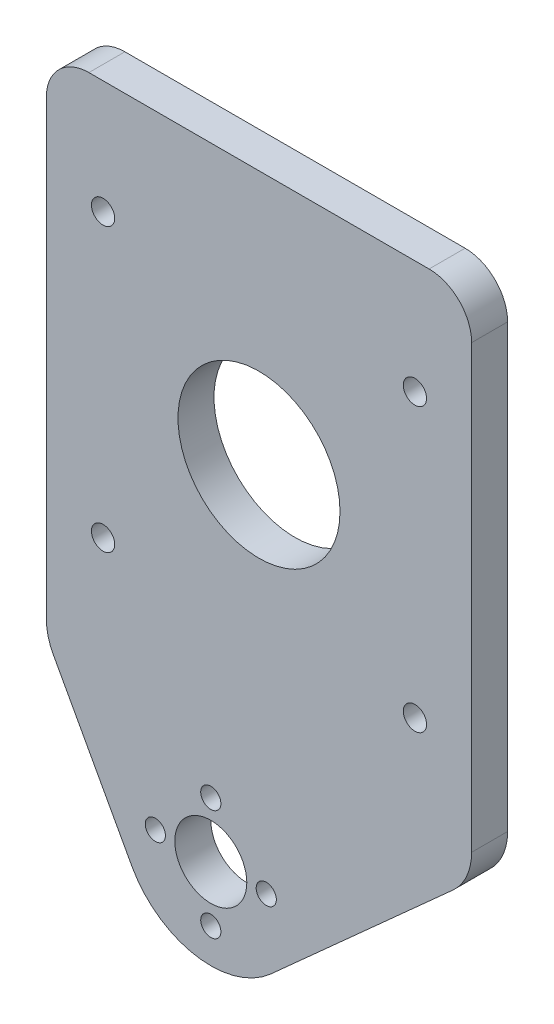
ISO-10303-21;
HEADER;
FILE_DESCRIPTION(('STEP AP214'),'2;1');
FILE_NAME('part.step','',(''),(''),'','','');
FILE_SCHEMA(('AUTOMOTIVE_DESIGN { 1 0 10303 214 1 1 1 1 }'));
ENDSEC;
DATA;
#1=APPLICATION_CONTEXT('core data for automotive mechanical design processes');
#2=APPLICATION_PROTOCOL_DEFINITION('international standard','automotive_design',2000,#1);
#3=PRODUCT_CONTEXT('',#1,'mechanical');
#4=PRODUCT('Part','Part','',(#3));
#5=PRODUCT_RELATED_PRODUCT_CATEGORY('part','',(#4));
#6=PRODUCT_DEFINITION_FORMATION('','',#4);
#7=PRODUCT_DEFINITION_CONTEXT('part definition',#1,'design');
#8=PRODUCT_DEFINITION('design','',#6,#7);
#9=PRODUCT_DEFINITION_SHAPE('','',#8);
#10=(LENGTH_UNIT() NAMED_UNIT(*) SI_UNIT(.MILLI.,.METRE.));
#11=(NAMED_UNIT(*) PLANE_ANGLE_UNIT() SI_UNIT($,.RADIAN.));
#12=(NAMED_UNIT(*) SI_UNIT($,.STERADIAN.) SOLID_ANGLE_UNIT());
#13=UNCERTAINTY_MEASURE_WITH_UNIT(LENGTH_MEASURE(1.E-05),#10,'distance_accuracy_value','');
#14=(GEOMETRIC_REPRESENTATION_CONTEXT(3) GLOBAL_UNCERTAINTY_ASSIGNED_CONTEXT((#13)) GLOBAL_UNIT_ASSIGNED_CONTEXT((#10,
#11,#12)) REPRESENTATION_CONTEXT('',''));
#15=CARTESIAN_POINT('',(0.,0.,0.));
#16=DIRECTION('',(0.,0.,1.));
#17=DIRECTION('',(1.,0.,0.));
#18=AXIS2_PLACEMENT_3D('',#15,#16,#17);
#19=CARTESIAN_POINT('',(0.,0.,6.35));
#20=DIRECTION('',(0.,0.,-1.));
#21=DIRECTION('',(-1.,0.,0.));
#22=AXIS2_PLACEMENT_3D('',#19,#20,#21);
#23=PLANE('',#22);
#24=CARTESIAN_POINT('',(179.9,20.,6.35));
#25=DIRECTION('',(0.,0.,1.));
#26=DIRECTION('',(-1.,0.,0.));
#27=AXIS2_PLACEMENT_3D('',#24,#25,#26);
#28=CIRCLE('',#27,2.04999999999999);
#29=CARTESIAN_POINT('',(177.85,20.,6.35));
#30=VERTEX_POINT('',#29);
#31=EDGE_CURVE('E250',#30,#30,#28,.T.);
#32=ORIENTED_EDGE('',*,*,#31,.F.);
#33=EDGE_LOOP('',(#32));
#34=FACE_BOUND('',#33,.T.);
#35=CARTESIAN_POINT('',(124.9,20.,6.35));
#36=DIRECTION('',(0.,0.,1.));
#37=DIRECTION('',(-1.,0.,0.));
#38=AXIS2_PLACEMENT_3D('',#35,#36,#37);
#39=CIRCLE('',#38,2.05000000000001);
#40=CARTESIAN_POINT('',(122.85,20.,6.35));
#41=VERTEX_POINT('',#40);
#42=EDGE_CURVE('E253',#41,#41,#39,.T.);
#43=ORIENTED_EDGE('',*,*,#42,.F.);
#44=EDGE_LOOP('',(#43));
#45=FACE_BOUND('',#44,.T.);
#46=CARTESIAN_POINT('',(124.9,69.8,6.35));
#47=DIRECTION('',(0.,0.,1.));
#48=DIRECTION('',(1.,0.,0.));
#49=AXIS2_PLACEMENT_3D('',#46,#47,#48);
#50=CIRCLE('',#49,2.05000000000001);
#51=CARTESIAN_POINT('',(126.95,69.8,6.35));
#52=VERTEX_POINT('',#51);
#53=EDGE_CURVE('E249',#52,#52,#50,.T.);
#54=ORIENTED_EDGE('',*,*,#53,.F.);
#55=EDGE_LOOP('',(#54));
#56=FACE_BOUND('',#55,.T.);
#57=CARTESIAN_POINT('',(179.9,69.8,6.35));
#58=DIRECTION('',(0.,0.,1.));
#59=DIRECTION('',(1.,0.,0.));
#60=AXIS2_PLACEMENT_3D('',#57,#58,#59);
#61=CIRCLE('',#60,2.04999999999999);
#62=CARTESIAN_POINT('',(181.95,69.8,6.35));
#63=VERTEX_POINT('',#62);
#64=EDGE_CURVE('E203',#63,#63,#61,.T.);
#65=ORIENTED_EDGE('',*,*,#64,.F.);
#66=EDGE_LOOP('',(#65));
#67=FACE_BOUND('',#66,.T.);
#68=CARTESIAN_POINT('',(152.4,44.9,6.35));
#69=DIRECTION('',(0.,0.,1.));
#70=DIRECTION('',(1.,0.,0.));
#71=AXIS2_PLACEMENT_3D('',#68,#69,#70);
#72=CIRCLE('',#71,14.2875);
#73=CARTESIAN_POINT('',(166.6875,44.9,6.35));
#74=VERTEX_POINT('',#73);
#75=EDGE_CURVE('E158',#74,#74,#72,.T.);
#76=ORIENTED_EDGE('',*,*,#75,.F.);
#77=EDGE_LOOP('',(#76));
#78=FACE_BOUND('',#77,.T.);
#79=DIRECTION('',(-1.,0.,0.));
#80=VECTOR('',#79,1.);
#81=CARTESIAN_POINT('',(0.,89.8,6.35));
#82=LINE('',#81,#80);
#83=CARTESIAN_POINT('',(182.4,89.8,6.35));
#84=VERTEX_POINT('',#83);
#85=CARTESIAN_POINT('',(122.4,89.8,6.35));
#86=VERTEX_POINT('',#85);
#87=EDGE_CURVE('E164',#84,#86,#82,.T.);
#88=ORIENTED_EDGE('',*,*,#87,.T.);
#89=CARTESIAN_POINT('',(122.4,82.3,6.35));
#90=DIRECTION('',(0.,0.,-1.));
#91=DIRECTION('',(-1.,0.,0.));
#92=AXIS2_PLACEMENT_3D('',#89,#90,#91);
#93=CIRCLE('',#92,7.5);
#94=CARTESIAN_POINT('',(114.9,82.3,6.35));
#95=VERTEX_POINT('',#94);
#96=EDGE_CURVE('E194',#86,#95,#93,.F.);
#97=ORIENTED_EDGE('',*,*,#96,.T.);
#98=DIRECTION('',(0.,1.,0.));
#99=VECTOR('',#98,1.);
#100=CARTESIAN_POINT('',(114.9,0.,6.35));
#101=LINE('',#100,#99);
#102=CARTESIAN_POINT('',(114.9,2.55111352936032,6.35));
#103=VERTEX_POINT('',#102);
#104=EDGE_CURVE('E151',#103,#95,#101,.T.);
#105=ORIENTED_EDGE('',*,*,#104,.F.);
#106=CARTESIAN_POINT('',(124.9,2.55111352936032,6.35));
#107=DIRECTION('',(0.,0.,-1.));
#108=DIRECTION('',(-1.,0.,0.));
#109=AXIS2_PLACEMENT_3D('',#106,#107,#108);
#110=CIRCLE('',#109,10.);
#111=CARTESIAN_POINT('',(116.122099603061,-2.23934204620073,6.35));
#112=VERTEX_POINT('',#111);
#113=EDGE_CURVE('E174',#103,#112,#110,.F.);
#114=ORIENTED_EDGE('',*,*,#113,.T.);
#115=DIRECTION('',(0.479045557556106,-0.877790039693867,0.));
#116=VECTOR('',#115,1.);
#117=CARTESIAN_POINT('',(114.9,0.,6.35));
#118=LINE('',#117,#116);
#119=CARTESIAN_POINT('',(129.96508311986,-27.6048482262032,6.35));
#120=VERTEX_POINT('',#119);
#121=EDGE_CURVE('E234',#112,#120,#118,.T.);
#122=ORIENTED_EDGE('',*,*,#121,.T.);
#123=CARTESIAN_POINT('',(143.9,-20.,6.35));
#124=DIRECTION('',(0.,0.,1.));
#125=DIRECTION('',(1.,0.,0.));
#126=AXIS2_PLACEMENT_3D('',#123,#124,#125);
#127=CIRCLE('',#126,15.875);
#128=CARTESIAN_POINT('',(154.51200148281,-31.8068221604642,6.35));
#129=VERTEX_POINT('',#128);
#130=EDGE_CURVE('E139',#120,#129,#127,.T.);
#131=ORIENTED_EDGE('',*,*,#130,.T.);
#132=DIRECTION('',(0.743736829005616,0.668472534350269,0.));
#133=VECTOR('',#132,1.);
#134=CARTESIAN_POINT('',(189.9,0.,6.35));
#135=LINE('',#134,#133);
#136=CARTESIAN_POINT('',(186.584725343503,-2.97977720783174,6.35));
#137=VERTEX_POINT('',#136);
#138=EDGE_CURVE('E220',#129,#137,#135,.T.);
#139=ORIENTED_EDGE('',*,*,#138,.T.);
#140=CARTESIAN_POINT('',(179.9,4.45759108222442,6.34999999999999));
#141=DIRECTION('',(0.,0.,-1.));
#142=DIRECTION('',(-1.,0.,0.));
#143=AXIS2_PLACEMENT_3D('',#140,#141,#142);
#144=CIRCLE('',#143,10.);
#145=CARTESIAN_POINT('',(189.9,4.45759108222442,6.35));
#146=VERTEX_POINT('',#145);
#147=EDGE_CURVE('E172',#137,#146,#144,.F.);
#148=ORIENTED_EDGE('',*,*,#147,.T.);
#149=DIRECTION('',(0.,1.,0.));
#150=VECTOR('',#149,1.);
#151=CARTESIAN_POINT('',(189.9,0.,6.35));
#152=LINE('',#151,#150);
#153=CARTESIAN_POINT('',(189.9,82.3,6.35));
#154=VERTEX_POINT('',#153);
#155=EDGE_CURVE('E147',#146,#154,#152,.T.);
#156=ORIENTED_EDGE('',*,*,#155,.T.);
#157=CARTESIAN_POINT('',(182.4,82.3,6.35));
#158=DIRECTION('',(0.,0.,-1.));
#159=DIRECTION('',(-1.,0.,0.));
#160=AXIS2_PLACEMENT_3D('',#157,#158,#159);
#161=CIRCLE('',#160,7.5);
#162=EDGE_CURVE('E192',#154,#84,#161,.F.);
#163=ORIENTED_EDGE('',*,*,#162,.T.);
#164=EDGE_LOOP('',(#88,#97,#105,#114,#122,#131,#139,#148,#156,#163));
#165=FACE_BOUND('',#164,.T.);
#166=CARTESIAN_POINT('',(143.9,-10.221,6.35));
#167=DIRECTION('',(0.,0.,1.));
#168=DIRECTION('',(1.,0.,0.));
#169=AXIS2_PLACEMENT_3D('',#166,#167,#168);
#170=CIRCLE('',#169,1.77799999999998);
#171=CARTESIAN_POINT('',(145.678,-10.221,6.35));
#172=VERTEX_POINT('',#171);
#173=EDGE_CURVE('E231',#172,#172,#170,.T.);
#174=ORIENTED_EDGE('',*,*,#173,.F.);
#175=EDGE_LOOP('',(#174));
#176=FACE_BOUND('',#175,.T.);
#177=CARTESIAN_POINT('',(153.679,-20.,6.35));
#178=DIRECTION('',(0.,0.,1.));
#179=DIRECTION('',(1.,0.,0.));
#180=AXIS2_PLACEMENT_3D('',#177,#178,#179);
#181=CIRCLE('',#180,1.77800000000001);
#182=CARTESIAN_POINT('',(155.457,-20.,6.35));
#183=VERTEX_POINT('',#182);
#184=EDGE_CURVE('E235',#183,#183,#181,.T.);
#185=ORIENTED_EDGE('',*,*,#184,.F.);
#186=EDGE_LOOP('',(#185));
#187=FACE_BOUND('',#186,.T.);
#188=CARTESIAN_POINT('',(134.121,-20.,6.35));
#189=DIRECTION('',(0.,0.,1.));
#190=DIRECTION('',(1.,0.,0.));
#191=AXIS2_PLACEMENT_3D('',#188,#189,#190);
#192=CIRCLE('',#191,1.77800000000001);
#193=CARTESIAN_POINT('',(135.899,-20.,6.35));
#194=VERTEX_POINT('',#193);
#195=EDGE_CURVE('E238',#194,#194,#192,.T.);
#196=ORIENTED_EDGE('',*,*,#195,.F.);
#197=EDGE_LOOP('',(#196));
#198=FACE_BOUND('',#197,.T.);
#199=CARTESIAN_POINT('',(143.9,-29.779,6.35));
#200=DIRECTION('',(0.,0.,1.));
#201=DIRECTION('',(1.,0.,0.));
#202=AXIS2_PLACEMENT_3D('',#199,#200,#201);
#203=CIRCLE('',#202,1.77800000000001);
#204=CARTESIAN_POINT('',(145.678,-29.779,6.35));
#205=VERTEX_POINT('',#204);
#206=EDGE_CURVE('E143',#205,#205,#203,.T.);
#207=ORIENTED_EDGE('',*,*,#206,.F.);
#208=EDGE_LOOP('',(#207));
#209=FACE_BOUND('',#208,.T.);
#210=CARTESIAN_POINT('',(143.9,-20.,6.35));
#211=DIRECTION('',(0.,0.,1.));
#212=DIRECTION('',(1.,0.,0.));
#213=AXIS2_PLACEMENT_3D('',#210,#211,#212);
#214=CIRCLE('',#213,6.35);
#215=CARTESIAN_POINT('',(150.25,-20.,6.35));
#216=VERTEX_POINT('',#215);
#217=EDGE_CURVE('E140',#216,#216,#214,.T.);
#218=ORIENTED_EDGE('',*,*,#217,.F.);
#219=EDGE_LOOP('',(#218));
#220=FACE_BOUND('',#219,.T.);
#221=ADVANCED_FACE('F34',(#34,#45,#56,#67,#78,#165,#176,#187,#198,#209,#220),#23,.F.);
#222=CARTESIAN_POINT('',(0.,0.,0.));
#223=DIRECTION('',(0.,0.,-1.));
#224=DIRECTION('',(-1.,0.,0.));
#225=AXIS2_PLACEMENT_3D('',#222,#223,#224);
#226=PLANE('',#225);
#227=CARTESIAN_POINT('',(179.9,20.,0.));
#228=DIRECTION('',(0.,0.,-1.));
#229=DIRECTION('',(-1.,0.,0.));
#230=AXIS2_PLACEMENT_3D('',#227,#228,#229);
#231=CIRCLE('',#230,2.04999999999999);
#232=CARTESIAN_POINT('',(177.85,20.,0.));
#233=VERTEX_POINT('',#232);
#234=EDGE_CURVE('E38',#233,#233,#231,.T.);
#235=ORIENTED_EDGE('',*,*,#234,.F.);
#236=EDGE_LOOP('',(#235));
#237=FACE_BOUND('',#236,.T.);
#238=CARTESIAN_POINT('',(124.9,20.,0.));
#239=DIRECTION('',(0.,0.,-1.));
#240=DIRECTION('',(-1.,0.,0.));
#241=AXIS2_PLACEMENT_3D('',#238,#239,#240);
#242=CIRCLE('',#241,2.05000000000001);
#243=CARTESIAN_POINT('',(122.85,20.,0.));
#244=VERTEX_POINT('',#243);
#245=EDGE_CURVE('E205',#244,#244,#242,.T.);
#246=ORIENTED_EDGE('',*,*,#245,.F.);
#247=EDGE_LOOP('',(#246));
#248=FACE_BOUND('',#247,.T.);
#249=CARTESIAN_POINT('',(124.9,69.8,0.));
#250=DIRECTION('',(0.,0.,-1.));
#251=DIRECTION('',(-1.,0.,0.));
#252=AXIS2_PLACEMENT_3D('',#249,#250,#251);
#253=CIRCLE('',#252,2.05000000000001);
#254=CARTESIAN_POINT('',(122.85,69.8,0.));
#255=VERTEX_POINT('',#254);
#256=EDGE_CURVE('E202',#255,#255,#253,.T.);
#257=ORIENTED_EDGE('',*,*,#256,.F.);
#258=EDGE_LOOP('',(#257));
#259=FACE_BOUND('',#258,.T.);
#260=CARTESIAN_POINT('',(179.9,69.8,0.));
#261=DIRECTION('',(0.,0.,-1.));
#262=DIRECTION('',(-1.,0.,0.));
#263=AXIS2_PLACEMENT_3D('',#260,#261,#262);
#264=CIRCLE('',#263,2.04999999999999);
#265=CARTESIAN_POINT('',(177.85,69.8,0.));
#266=VERTEX_POINT('',#265);
#267=EDGE_CURVE('E199',#266,#266,#264,.T.);
#268=ORIENTED_EDGE('',*,*,#267,.F.);
#269=EDGE_LOOP('',(#268));
#270=FACE_BOUND('',#269,.T.);
#271=CARTESIAN_POINT('',(152.4,44.9,0.));
#272=DIRECTION('',(0.,0.,1.));
#273=DIRECTION('',(1.,0.,0.));
#274=AXIS2_PLACEMENT_3D('',#271,#272,#273);
#275=CIRCLE('',#274,14.2875);
#276=CARTESIAN_POINT('',(166.6875,44.9,0.));
#277=VERTEX_POINT('',#276);
#278=EDGE_CURVE('E157',#277,#277,#275,.T.);
#279=ORIENTED_EDGE('',*,*,#278,.T.);
#280=EDGE_LOOP('',(#279));
#281=FACE_BOUND('',#280,.T.);
#282=DIRECTION('',(0.,-1.,0.));
#283=VECTOR('',#282,1.);
#284=CARTESIAN_POINT('',(114.9,0.,0.));
#285=LINE('',#284,#283);
#286=CARTESIAN_POINT('',(114.9,82.3,0.));
#287=VERTEX_POINT('',#286);
#288=CARTESIAN_POINT('',(114.9,2.55111352936032,0.));
#289=VERTEX_POINT('',#288);
#290=EDGE_CURVE('E150',#287,#289,#285,.T.);
#291=ORIENTED_EDGE('',*,*,#290,.F.);
#292=CARTESIAN_POINT('',(122.4,82.3,0.));
#293=DIRECTION('',(0.,0.,-1.));
#294=DIRECTION('',(-1.,0.,0.));
#295=AXIS2_PLACEMENT_3D('',#292,#293,#294);
#296=CIRCLE('',#295,7.5);
#297=CARTESIAN_POINT('',(122.4,89.8,0.));
#298=VERTEX_POINT('',#297);
#299=EDGE_CURVE('E43',#287,#298,#296,.T.);
#300=ORIENTED_EDGE('',*,*,#299,.T.);
#301=DIRECTION('',(-1.,0.,0.));
#302=VECTOR('',#301,1.);
#303=CARTESIAN_POINT('',(0.,89.8,0.));
#304=LINE('',#303,#302);
#305=CARTESIAN_POINT('',(182.4,89.8,0.));
#306=VERTEX_POINT('',#305);
#307=EDGE_CURVE('E161',#306,#298,#304,.T.);
#308=ORIENTED_EDGE('',*,*,#307,.F.);
#309=CARTESIAN_POINT('',(182.4,82.3,0.));
#310=DIRECTION('',(0.,0.,-1.));
#311=DIRECTION('',(-1.,0.,0.));
#312=AXIS2_PLACEMENT_3D('',#309,#310,#311);
#313=CIRCLE('',#312,7.5);
#314=CARTESIAN_POINT('',(189.9,82.3,0.));
#315=VERTEX_POINT('',#314);
#316=EDGE_CURVE('E51',#306,#315,#313,.T.);
#317=ORIENTED_EDGE('',*,*,#316,.T.);
#318=DIRECTION('',(0.,-1.,0.));
#319=VECTOR('',#318,1.);
#320=CARTESIAN_POINT('',(189.9,0.,0.));
#321=LINE('',#320,#319);
#322=CARTESIAN_POINT('',(189.9,4.45759108222442,0.));
#323=VERTEX_POINT('',#322);
#324=EDGE_CURVE('E155',#315,#323,#321,.T.);
#325=ORIENTED_EDGE('',*,*,#324,.T.);
#326=CARTESIAN_POINT('',(179.9,4.45759108222442,0.));
#327=DIRECTION('',(0.,0.,-1.));
#328=DIRECTION('',(-1.,0.,0.));
#329=AXIS2_PLACEMENT_3D('',#326,#327,#328);
#330=CIRCLE('',#329,10.);
#331=CARTESIAN_POINT('',(186.584725343503,-2.97977720783174,0.));
#332=VERTEX_POINT('',#331);
#333=EDGE_CURVE('E177',#323,#332,#330,.T.);
#334=ORIENTED_EDGE('',*,*,#333,.T.);
#335=DIRECTION('',(0.743736829005616,0.668472534350269,0.));
#336=VECTOR('',#335,1.);
#337=CARTESIAN_POINT('',(189.9,0.,0.));
#338=LINE('',#337,#336);
#339=CARTESIAN_POINT('',(154.51200148281,-31.8068221604642,0.));
#340=VERTEX_POINT('',#339);
#341=EDGE_CURVE('E133',#340,#332,#338,.T.);
#342=ORIENTED_EDGE('',*,*,#341,.F.);
#343=CARTESIAN_POINT('',(143.9,-20.,0.));
#344=DIRECTION('',(0.,0.,-1.));
#345=DIRECTION('',(-1.,0.,0.));
#346=AXIS2_PLACEMENT_3D('',#343,#344,#345);
#347=CIRCLE('',#346,15.875);
#348=CARTESIAN_POINT('',(129.96508311986,-27.6048482262032,0.));
#349=VERTEX_POINT('',#348);
#350=EDGE_CURVE('E129',#349,#340,#347,.F.);
#351=ORIENTED_EDGE('',*,*,#350,.F.);
#352=DIRECTION('',(0.479045557556106,-0.877790039693867,0.));
#353=VECTOR('',#352,1.);
#354=CARTESIAN_POINT('',(114.9,0.,0.));
#355=LINE('',#354,#353);
#356=CARTESIAN_POINT('',(116.122099603061,-2.23934204620074,0.));
#357=VERTEX_POINT('',#356);
#358=EDGE_CURVE('E115',#357,#349,#355,.T.);
#359=ORIENTED_EDGE('',*,*,#358,.F.);
#360=CARTESIAN_POINT('',(124.9,2.55111352936032,0.));
#361=DIRECTION('',(0.,0.,-1.));
#362=DIRECTION('',(-1.,0.,0.));
#363=AXIS2_PLACEMENT_3D('',#360,#361,#362);
#364=CIRCLE('',#363,10.);
#365=EDGE_CURVE('E179',#357,#289,#364,.T.);
#366=ORIENTED_EDGE('',*,*,#365,.T.);
#367=EDGE_LOOP('',(#291,#300,#308,#317,#325,#334,#342,#351,#359,#366));
#368=FACE_BOUND('',#367,.T.);
#369=CARTESIAN_POINT('',(143.9,-29.779,0.));
#370=DIRECTION('',(0.,0.,-1.));
#371=DIRECTION('',(-1.,0.,0.));
#372=AXIS2_PLACEMENT_3D('',#369,#370,#371);
#373=CIRCLE('',#372,1.77800000000001);
#374=CARTESIAN_POINT('',(142.122,-29.779,0.));
#375=VERTEX_POINT('',#374);
#376=EDGE_CURVE('E216',#375,#375,#373,.F.);
#377=ORIENTED_EDGE('',*,*,#376,.T.);
#378=EDGE_LOOP('',(#377));
#379=FACE_BOUND('',#378,.T.);
#380=CARTESIAN_POINT('',(153.679,-20.,0.));
#381=DIRECTION('',(0.,0.,-1.));
#382=DIRECTION('',(-1.,0.,0.));
#383=AXIS2_PLACEMENT_3D('',#380,#381,#382);
#384=CIRCLE('',#383,1.77800000000001);
#385=CARTESIAN_POINT('',(151.901,-20.,0.));
#386=VERTEX_POINT('',#385);
#387=EDGE_CURVE('E219',#386,#386,#384,.F.);
#388=ORIENTED_EDGE('',*,*,#387,.T.);
#389=EDGE_LOOP('',(#388));
#390=FACE_BOUND('',#389,.T.);
#391=CARTESIAN_POINT('',(143.9,-10.221,0.));
#392=DIRECTION('',(0.,0.,-1.));
#393=DIRECTION('',(-1.,0.,0.));
#394=AXIS2_PLACEMENT_3D('',#391,#392,#393);
#395=CIRCLE('',#394,1.77799999999998);
#396=CARTESIAN_POINT('',(142.122,-10.221,0.));
#397=VERTEX_POINT('',#396);
#398=EDGE_CURVE('E223',#397,#397,#395,.F.);
#399=ORIENTED_EDGE('',*,*,#398,.T.);
#400=EDGE_LOOP('',(#399));
#401=FACE_BOUND('',#400,.T.);
#402=CARTESIAN_POINT('',(134.121,-20.,0.));
#403=DIRECTION('',(0.,0.,-1.));
#404=DIRECTION('',(-1.,0.,0.));
#405=AXIS2_PLACEMENT_3D('',#402,#403,#404);
#406=CIRCLE('',#405,1.77800000000001);
#407=CARTESIAN_POINT('',(132.343,-20.,0.));
#408=VERTEX_POINT('',#407);
#409=EDGE_CURVE('E226',#408,#408,#406,.F.);
#410=ORIENTED_EDGE('',*,*,#409,.T.);
#411=EDGE_LOOP('',(#410));
#412=FACE_BOUND('',#411,.T.);
#413=CARTESIAN_POINT('',(143.9,-20.,0.));
#414=DIRECTION('',(0.,0.,-1.));
#415=DIRECTION('',(-1.,0.,0.));
#416=AXIS2_PLACEMENT_3D('',#413,#414,#415);
#417=CIRCLE('',#416,6.35);
#418=CARTESIAN_POINT('',(137.55,-20.,0.));
#419=VERTEX_POINT('',#418);
#420=EDGE_CURVE('E153',#419,#419,#417,.F.);
#421=ORIENTED_EDGE('',*,*,#420,.T.);
#422=EDGE_LOOP('',(#421));
#423=FACE_BOUND('',#422,.T.);
#424=ADVANCED_FACE('F130',(#237,#248,#259,#270,#281,#368,#379,#390,#401,#412,#423),#226,.T.);
#425=CARTESIAN_POINT('',(0.,89.8,6.35));
#426=DIRECTION('',(0.,-1.,0.));
#427=DIRECTION('',(0.,0.,-1.));
#428=AXIS2_PLACEMENT_3D('',#425,#426,#427);
#429=PLANE('',#428);
#430=ORIENTED_EDGE('',*,*,#307,.T.);
#431=DIRECTION('',(0.,0.,1.));
#432=VECTOR('',#431,1.);
#433=CARTESIAN_POINT('',(122.4,89.8,6.35));
#434=LINE('',#433,#432);
#435=EDGE_CURVE('E189',#298,#86,#434,.T.);
#436=ORIENTED_EDGE('',*,*,#435,.T.);
#437=ORIENTED_EDGE('',*,*,#87,.F.);
#438=DIRECTION('',(0.,0.,1.));
#439=VECTOR('',#438,1.);
#440=CARTESIAN_POINT('',(182.4,89.8,0.));
#441=LINE('',#440,#439);
#442=EDGE_CURVE('E187',#84,#306,#441,.F.);
#443=ORIENTED_EDGE('',*,*,#442,.T.);
#444=EDGE_LOOP('',(#430,#436,#437,#443));
#445=FACE_BOUND('',#444,.T.);
#446=ADVANCED_FACE('F289',(#445),#429,.F.);
#447=CARTESIAN_POINT('',(152.4,44.9,6.35));
#448=DIRECTION('',(0.,0.,-1.));
#449=DIRECTION('',(-1.,0.,0.));
#450=AXIS2_PLACEMENT_3D('',#447,#448,#449);
#451=CYLINDRICAL_SURFACE('',#450,14.2875);
#452=ORIENTED_EDGE('',*,*,#75,.T.);
#453=EDGE_LOOP('',(#452));
#454=FACE_BOUND('',#453,.T.);
#455=ORIENTED_EDGE('',*,*,#278,.F.);
#456=EDGE_LOOP('',(#455));
#457=FACE_BOUND('',#456,.T.);
#458=ADVANCED_FACE('F295',(#454,#457),#451,.F.);
#459=CARTESIAN_POINT('',(114.9,0.,-3.65));
#460=DIRECTION('',(1.,0.,0.));
#461=DIRECTION('',(0.,0.,-1.));
#462=AXIS2_PLACEMENT_3D('',#459,#460,#461);
#463=PLANE('',#462);
#464=ORIENTED_EDGE('',*,*,#104,.T.);
#465=DIRECTION('',(0.,0.,1.));
#466=VECTOR('',#465,1.);
#467=CARTESIAN_POINT('',(114.9,82.3,-3.65));
#468=LINE('',#467,#466);
#469=EDGE_CURVE('E59',#95,#287,#468,.F.);
#470=ORIENTED_EDGE('',*,*,#469,.T.);
#471=ORIENTED_EDGE('',*,*,#290,.T.);
#472=DIRECTION('',(0.,0.,1.));
#473=VECTOR('',#472,1.);
#474=CARTESIAN_POINT('',(114.9,2.55111352936032,6.35));
#475=LINE('',#474,#473);
#476=EDGE_CURVE('E167',#289,#103,#475,.T.);
#477=ORIENTED_EDGE('',*,*,#476,.T.);
#478=EDGE_LOOP('',(#464,#470,#471,#477));
#479=FACE_BOUND('',#478,.T.);
#480=ADVANCED_FACE('F330',(#479),#463,.F.);
#481=CARTESIAN_POINT('',(189.9,0.,-3.65));
#482=DIRECTION('',(1.,0.,0.));
#483=DIRECTION('',(0.,0.,-1.));
#484=AXIS2_PLACEMENT_3D('',#481,#482,#483);
#485=PLANE('',#484);
#486=ORIENTED_EDGE('',*,*,#324,.F.);
#487=DIRECTION('',(0.,0.,1.));
#488=VECTOR('',#487,1.);
#489=CARTESIAN_POINT('',(189.9,82.3,6.35));
#490=LINE('',#489,#488);
#491=EDGE_CURVE('E11',#315,#154,#490,.T.);
#492=ORIENTED_EDGE('',*,*,#491,.T.);
#493=ORIENTED_EDGE('',*,*,#155,.F.);
#494=DIRECTION('',(0.,0.,1.));
#495=VECTOR('',#494,1.);
#496=CARTESIAN_POINT('',(189.9,4.45759108222442,-3.65));
#497=LINE('',#496,#495);
#498=EDGE_CURVE('E184',#146,#323,#497,.F.);
#499=ORIENTED_EDGE('',*,*,#498,.T.);
#500=EDGE_LOOP('',(#486,#492,#493,#499));
#501=FACE_BOUND('',#500,.T.);
#502=ADVANCED_FACE('F323',(#501),#485,.T.);
#503=CARTESIAN_POINT('',(189.9,0.,-83.1385327330234));
#504=DIRECTION('',(0.668472534350269,-0.743736829005616,0.));
#505=DIRECTION('',(0.743736829005616,0.668472534350269,0.));
#506=AXIS2_PLACEMENT_3D('',#503,#504,#505);
#507=PLANE('',#506);
#508=ORIENTED_EDGE('',*,*,#341,.T.);
#509=DIRECTION('',(0.,0.,1.));
#510=VECTOR('',#509,1.);
#511=CARTESIAN_POINT('',(186.584725343503,-2.97977720783174,-83.1385327330234));
#512=LINE('',#511,#510);
#513=EDGE_CURVE('E181',#332,#137,#512,.T.);
#514=ORIENTED_EDGE('',*,*,#513,.T.);
#515=ORIENTED_EDGE('',*,*,#138,.F.);
#516=DIRECTION('',(0.,0.,1.));
#517=VECTOR('',#516,1.);
#518=CARTESIAN_POINT('',(154.51200148281,-31.8068221604642,-83.1385327330234));
#519=LINE('',#518,#517);
#520=EDGE_CURVE('E126',#340,#129,#519,.T.);
#521=ORIENTED_EDGE('',*,*,#520,.F.);
#522=EDGE_LOOP('',(#508,#514,#515,#521));
#523=FACE_BOUND('',#522,.T.);
#524=ADVANCED_FACE('F327',(#523),#507,.T.);
#525=CARTESIAN_POINT('',(143.9,-20.,-83.1385327330234));
#526=DIRECTION('',(0.,0.,1.));
#527=DIRECTION('',(1.,0.,0.));
#528=AXIS2_PLACEMENT_3D('',#525,#526,#527);
#529=CYLINDRICAL_SURFACE('',#528,15.875);
#530=DIRECTION('',(0.,0.,1.));
#531=VECTOR('',#530,1.);
#532=CARTESIAN_POINT('',(129.96508311986,-27.6048482262032,-83.1385327330234));
#533=LINE('',#532,#531);
#534=EDGE_CURVE('E120',#349,#120,#533,.T.);
#535=ORIENTED_EDGE('',*,*,#534,.F.);
#536=ORIENTED_EDGE('',*,*,#350,.T.);
#537=ORIENTED_EDGE('',*,*,#520,.T.);
#538=ORIENTED_EDGE('',*,*,#130,.F.);
#539=EDGE_LOOP('',(#535,#536,#537,#538));
#540=FACE_BOUND('',#539,.T.);
#541=ADVANCED_FACE('F137',(#540),#529,.T.);
#542=CARTESIAN_POINT('',(114.9,0.,-83.1385327330234));
#543=DIRECTION('',(-0.877790039693867,-0.479045557556106,0.));
#544=DIRECTION('',(0.479045557556106,-0.877790039693867,0.));
#545=AXIS2_PLACEMENT_3D('',#542,#543,#544);
#546=PLANE('',#545);
#547=ORIENTED_EDGE('',*,*,#121,.F.);
#548=DIRECTION('',(0.,0.,1.));
#549=VECTOR('',#548,1.);
#550=CARTESIAN_POINT('',(116.122099603061,-2.23934204620074,0.));
#551=LINE('',#550,#549);
#552=EDGE_CURVE('E123',#112,#357,#551,.F.);
#553=ORIENTED_EDGE('',*,*,#552,.T.);
#554=ORIENTED_EDGE('',*,*,#358,.T.);
#555=ORIENTED_EDGE('',*,*,#534,.T.);
#556=EDGE_LOOP('',(#547,#553,#554,#555));
#557=FACE_BOUND('',#556,.T.);
#558=ADVANCED_FACE('F118',(#557),#546,.T.);
#559=CARTESIAN_POINT('',(143.9,-20.,-83.1385327330234));
#560=DIRECTION('',(0.,0.,1.));
#561=DIRECTION('',(1.,0.,0.));
#562=AXIS2_PLACEMENT_3D('',#559,#560,#561);
#563=CYLINDRICAL_SURFACE('',#562,6.35);
#564=ORIENTED_EDGE('',*,*,#217,.T.);
#565=EDGE_LOOP('',(#564));
#566=FACE_BOUND('',#565,.T.);
#567=ORIENTED_EDGE('',*,*,#420,.F.);
#568=EDGE_LOOP('',(#567));
#569=FACE_BOUND('',#568,.T.);
#570=ADVANCED_FACE('F281',(#566,#569),#563,.F.);
#571=CARTESIAN_POINT('',(143.9,-29.779,-83.1385327330234));
#572=DIRECTION('',(0.,0.,1.));
#573=DIRECTION('',(1.,0.,0.));
#574=AXIS2_PLACEMENT_3D('',#571,#572,#573);
#575=CYLINDRICAL_SURFACE('',#574,1.77800000000001);
#576=ORIENTED_EDGE('',*,*,#206,.T.);
#577=EDGE_LOOP('',(#576));
#578=FACE_BOUND('',#577,.T.);
#579=ORIENTED_EDGE('',*,*,#376,.F.);
#580=EDGE_LOOP('',(#579));
#581=FACE_BOUND('',#580,.T.);
#582=ADVANCED_FACE('F284',(#578,#581),#575,.F.);
#583=CARTESIAN_POINT('',(134.121,-20.,-83.1385327330234));
#584=DIRECTION('',(0.,0.,1.));
#585=DIRECTION('',(1.,0.,0.));
#586=AXIS2_PLACEMENT_3D('',#583,#584,#585);
#587=CYLINDRICAL_SURFACE('',#586,1.77800000000001);
#588=ORIENTED_EDGE('',*,*,#195,.T.);
#589=EDGE_LOOP('',(#588));
#590=FACE_BOUND('',#589,.T.);
#591=ORIENTED_EDGE('',*,*,#409,.F.);
#592=EDGE_LOOP('',(#591));
#593=FACE_BOUND('',#592,.T.);
#594=ADVANCED_FACE('F346',(#590,#593),#587,.F.);
#595=CARTESIAN_POINT('',(153.679,-20.,-83.1385327330234));
#596=DIRECTION('',(0.,0.,1.));
#597=DIRECTION('',(1.,0.,0.));
#598=AXIS2_PLACEMENT_3D('',#595,#596,#597);
#599=CYLINDRICAL_SURFACE('',#598,1.77800000000001);
#600=ORIENTED_EDGE('',*,*,#184,.T.);
#601=EDGE_LOOP('',(#600));
#602=FACE_BOUND('',#601,.T.);
#603=ORIENTED_EDGE('',*,*,#387,.F.);
#604=EDGE_LOOP('',(#603));
#605=FACE_BOUND('',#604,.T.);
#606=ADVANCED_FACE('F342',(#602,#605),#599,.F.);
#607=CARTESIAN_POINT('',(143.9,-10.221,-83.1385327330234));
#608=DIRECTION('',(0.,0.,1.));
#609=DIRECTION('',(1.,0.,0.));
#610=AXIS2_PLACEMENT_3D('',#607,#608,#609);
#611=CYLINDRICAL_SURFACE('',#610,1.77799999999998);
#612=ORIENTED_EDGE('',*,*,#173,.T.);
#613=EDGE_LOOP('',(#612));
#614=FACE_BOUND('',#613,.T.);
#615=ORIENTED_EDGE('',*,*,#398,.F.);
#616=EDGE_LOOP('',(#615));
#617=FACE_BOUND('',#616,.T.);
#618=ADVANCED_FACE('F305',(#614,#617),#611,.F.);
#619=CARTESIAN_POINT('',(124.9,2.55111352936032,-3.65));
#620=DIRECTION('',(0.,0.,-1.));
#621=DIRECTION('',(-1.,0.,0.));
#622=AXIS2_PLACEMENT_3D('',#619,#620,#621);
#623=CYLINDRICAL_SURFACE('',#622,10.);
#624=ORIENTED_EDGE('',*,*,#365,.F.);
#625=ORIENTED_EDGE('',*,*,#552,.F.);
#626=ORIENTED_EDGE('',*,*,#113,.F.);
#627=ORIENTED_EDGE('',*,*,#476,.F.);
#628=EDGE_LOOP('',(#624,#625,#626,#627));
#629=FACE_BOUND('',#628,.T.);
#630=ADVANCED_FACE('F301',(#629),#623,.T.);
#631=CARTESIAN_POINT('',(179.9,4.45759108222442,-83.1385327330234));
#632=DIRECTION('',(0.,0.,1.));
#633=DIRECTION('',(1.,0.,0.));
#634=AXIS2_PLACEMENT_3D('',#631,#632,#633);
#635=CYLINDRICAL_SURFACE('',#634,10.);
#636=ORIENTED_EDGE('',*,*,#333,.F.);
#637=ORIENTED_EDGE('',*,*,#498,.F.);
#638=ORIENTED_EDGE('',*,*,#147,.F.);
#639=ORIENTED_EDGE('',*,*,#513,.F.);
#640=EDGE_LOOP('',(#636,#637,#638,#639));
#641=FACE_BOUND('',#640,.T.);
#642=ADVANCED_FACE('F304',(#641),#635,.T.);
#643=CARTESIAN_POINT('',(122.4,82.3,6.35));
#644=DIRECTION('',(0.,0.,1.));
#645=DIRECTION('',(1.,0.,0.));
#646=AXIS2_PLACEMENT_3D('',#643,#644,#645);
#647=CYLINDRICAL_SURFACE('',#646,7.5);
#648=ORIENTED_EDGE('',*,*,#299,.F.);
#649=ORIENTED_EDGE('',*,*,#469,.F.);
#650=ORIENTED_EDGE('',*,*,#96,.F.);
#651=ORIENTED_EDGE('',*,*,#435,.F.);
#652=EDGE_LOOP('',(#648,#649,#650,#651));
#653=FACE_BOUND('',#652,.T.);
#654=ADVANCED_FACE('F308',(#653),#647,.T.);
#655=CARTESIAN_POINT('',(182.4,82.3,-3.65));
#656=DIRECTION('',(0.,0.,-1.));
#657=DIRECTION('',(-1.,0.,0.));
#658=AXIS2_PLACEMENT_3D('',#655,#656,#657);
#659=CYLINDRICAL_SURFACE('',#658,7.5);
#660=ORIENTED_EDGE('',*,*,#316,.F.);
#661=ORIENTED_EDGE('',*,*,#442,.F.);
#662=ORIENTED_EDGE('',*,*,#162,.F.);
#663=ORIENTED_EDGE('',*,*,#491,.F.);
#664=EDGE_LOOP('',(#660,#661,#662,#663));
#665=FACE_BOUND('',#664,.T.);
#666=ADVANCED_FACE('F36',(#665),#659,.T.);
#667=CARTESIAN_POINT('',(179.9,69.8,-3.65));
#668=DIRECTION('',(0.,0.,1.));
#669=DIRECTION('',(1.,0.,0.));
#670=AXIS2_PLACEMENT_3D('',#667,#668,#669);
#671=CYLINDRICAL_SURFACE('',#670,2.04999999999999);
#672=ORIENTED_EDGE('',*,*,#267,.T.);
#673=EDGE_LOOP('',(#672));
#674=FACE_BOUND('',#673,.T.);
#675=ORIENTED_EDGE('',*,*,#64,.T.);
#676=EDGE_LOOP('',(#675));
#677=FACE_BOUND('',#676,.T.);
#678=ADVANCED_FACE('F315',(#674,#677),#671,.F.);
#679=CARTESIAN_POINT('',(124.9,69.8,-3.65));
#680=DIRECTION('',(0.,0.,1.));
#681=DIRECTION('',(1.,0.,0.));
#682=AXIS2_PLACEMENT_3D('',#679,#680,#681);
#683=CYLINDRICAL_SURFACE('',#682,2.05000000000001);
#684=ORIENTED_EDGE('',*,*,#256,.T.);
#685=EDGE_LOOP('',(#684));
#686=FACE_BOUND('',#685,.T.);
#687=ORIENTED_EDGE('',*,*,#53,.T.);
#688=EDGE_LOOP('',(#687));
#689=FACE_BOUND('',#688,.T.);
#690=ADVANCED_FACE('F259',(#686,#689),#683,.F.);
#691=CARTESIAN_POINT('',(124.9,20.,-3.65));
#692=DIRECTION('',(0.,0.,1.));
#693=DIRECTION('',(1.,0.,0.));
#694=AXIS2_PLACEMENT_3D('',#691,#692,#693);
#695=CYLINDRICAL_SURFACE('',#694,2.05000000000001);
#696=ORIENTED_EDGE('',*,*,#245,.T.);
#697=EDGE_LOOP('',(#696));
#698=FACE_BOUND('',#697,.T.);
#699=ORIENTED_EDGE('',*,*,#42,.T.);
#700=EDGE_LOOP('',(#699));
#701=FACE_BOUND('',#700,.T.);
#702=ADVANCED_FACE('F366',(#698,#701),#695,.F.);
#703=CARTESIAN_POINT('',(179.9,20.,-3.65));
#704=DIRECTION('',(0.,0.,1.));
#705=DIRECTION('',(1.,0.,0.));
#706=AXIS2_PLACEMENT_3D('',#703,#704,#705);
#707=CYLINDRICAL_SURFACE('',#706,2.04999999999999);
#708=ORIENTED_EDGE('',*,*,#234,.T.);
#709=EDGE_LOOP('',(#708));
#710=FACE_BOUND('',#709,.T.);
#711=ORIENTED_EDGE('',*,*,#31,.T.);
#712=EDGE_LOOP('',(#711));
#713=FACE_BOUND('',#712,.T.);
#714=ADVANCED_FACE('F363',(#710,#713),#707,.F.);
#715=CLOSED_SHELL('',(#221,#424,#446,#458,#480,#502,#524,#541,#558,#570,#582,#594,#606,#618,
#630,#642,#654,#666,#678,#690,#702,#714));
#716=MANIFOLD_SOLID_BREP('B2',#715);
#717=ADVANCED_BREP_SHAPE_REPRESENTATION('',(#18,#716),#14);
#718=SHAPE_DEFINITION_REPRESENTATION(#9,#717);
ENDSEC;
END-ISO-10303-21;
